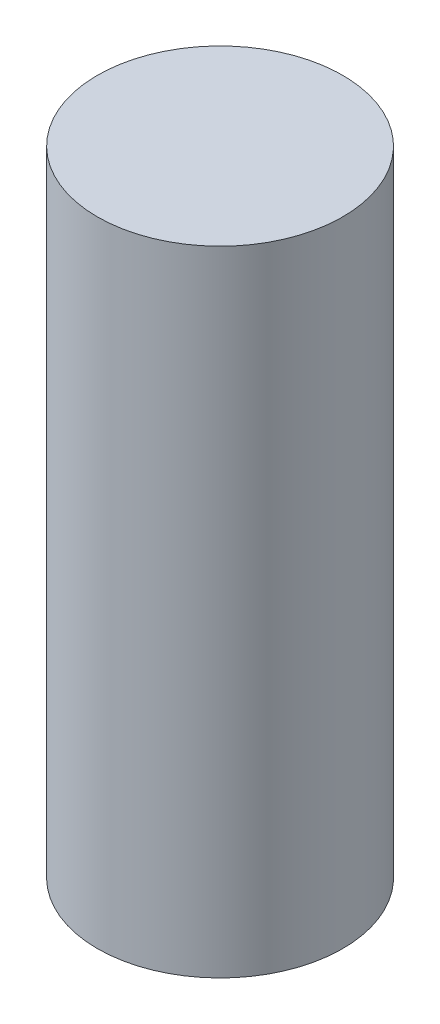
ISO-10303-21;
HEADER;
FILE_DESCRIPTION(('STEP AP214'),'2;1');
FILE_NAME('part.step','',(''),(''),'','','');
FILE_SCHEMA(('AUTOMOTIVE_DESIGN { 1 0 10303 214 1 1 1 1 }'));
ENDSEC;
DATA;
#1=APPLICATION_CONTEXT('core data for automotive mechanical design processes');
#2=APPLICATION_PROTOCOL_DEFINITION('international standard','automotive_design',2000,#1);
#3=PRODUCT_CONTEXT('',#1,'mechanical');
#4=PRODUCT('Part','Part','',(#3));
#5=PRODUCT_RELATED_PRODUCT_CATEGORY('part','',(#4));
#6=PRODUCT_DEFINITION_FORMATION('','',#4);
#7=PRODUCT_DEFINITION_CONTEXT('part definition',#1,'design');
#8=PRODUCT_DEFINITION('design','',#6,#7);
#9=PRODUCT_DEFINITION_SHAPE('','',#8);
#10=(LENGTH_UNIT() NAMED_UNIT(*) SI_UNIT(.MILLI.,.METRE.));
#11=(NAMED_UNIT(*) PLANE_ANGLE_UNIT() SI_UNIT($,.RADIAN.));
#12=(NAMED_UNIT(*) SI_UNIT($,.STERADIAN.) SOLID_ANGLE_UNIT());
#13=UNCERTAINTY_MEASURE_WITH_UNIT(LENGTH_MEASURE(1.E-05),#10,'distance_accuracy_value','');
#14=(GEOMETRIC_REPRESENTATION_CONTEXT(3) GLOBAL_UNCERTAINTY_ASSIGNED_CONTEXT((#13)) GLOBAL_UNIT_ASSIGNED_CONTEXT((#10,
#11,#12)) REPRESENTATION_CONTEXT('',''));
#15=CARTESIAN_POINT('',(0.,0.,0.));
#16=DIRECTION('',(0.,0.,1.));
#17=DIRECTION('',(1.,0.,0.));
#18=AXIS2_PLACEMENT_3D('',#15,#16,#17);
#19=CARTESIAN_POINT('',(0.,31.,0.));
#20=DIRECTION('',(0.,-1.,0.));
#21=DIRECTION('',(0.,0.,-1.));
#22=AXIS2_PLACEMENT_3D('',#19,#20,#21);
#23=CYLINDRICAL_SURFACE('',#22,6.);
#24=CARTESIAN_POINT('',(0.,31.,0.));
#25=DIRECTION('',(0.,1.,0.));
#26=DIRECTION('',(0.,0.,1.));
#27=AXIS2_PLACEMENT_3D('',#24,#25,#26);
#28=CIRCLE('',#27,6.);
#29=CARTESIAN_POINT('',(0.,31.,6.));
#30=VERTEX_POINT('',#29);
#31=EDGE_CURVE('E10',#30,#30,#28,.T.);
#32=ORIENTED_EDGE('',*,*,#31,.F.);
#33=EDGE_LOOP('',(#32));
#34=FACE_BOUND('',#33,.T.);
#35=CARTESIAN_POINT('',(0.,0.,0.));
#36=DIRECTION('',(0.,1.,0.));
#37=DIRECTION('',(0.,0.,1.));
#38=AXIS2_PLACEMENT_3D('',#35,#36,#37);
#39=CIRCLE('',#38,6.);
#40=CARTESIAN_POINT('',(0.,0.,6.));
#41=VERTEX_POINT('',#40);
#42=EDGE_CURVE('E35',#41,#41,#39,.T.);
#43=ORIENTED_EDGE('',*,*,#42,.T.);
#44=EDGE_LOOP('',(#43));
#45=FACE_BOUND('',#44,.T.);
#46=ADVANCED_FACE('F32',(#34,#45),#23,.T.);
#47=CARTESIAN_POINT('',(0.,31.,0.));
#48=DIRECTION('',(0.,1.,0.));
#49=DIRECTION('',(0.,0.,1.));
#50=AXIS2_PLACEMENT_3D('',#47,#48,#49);
#51=PLANE('',#50);
#52=ORIENTED_EDGE('',*,*,#31,.T.);
#53=EDGE_LOOP('',(#52));
#54=FACE_BOUND('',#53,.T.);
#55=ADVANCED_FACE('F47',(#54),#51,.T.);
#56=CARTESIAN_POINT('',(0.,0.,0.));
#57=DIRECTION('',(0.,1.,0.));
#58=DIRECTION('',(0.,0.,1.));
#59=AXIS2_PLACEMENT_3D('',#56,#57,#58);
#60=PLANE('',#59);
#61=ORIENTED_EDGE('',*,*,#42,.F.);
#62=EDGE_LOOP('',(#61));
#63=FACE_BOUND('',#62,.T.);
#64=ADVANCED_FACE('F45',(#63),#60,.F.);
#65=CLOSED_SHELL('',(#46,#55,#64));
#66=MANIFOLD_SOLID_BREP('B2',#65);
#67=ADVANCED_BREP_SHAPE_REPRESENTATION('',(#18,#66),#14);
#68=SHAPE_DEFINITION_REPRESENTATION(#9,#67);
ENDSEC;
END-ISO-10303-21;
